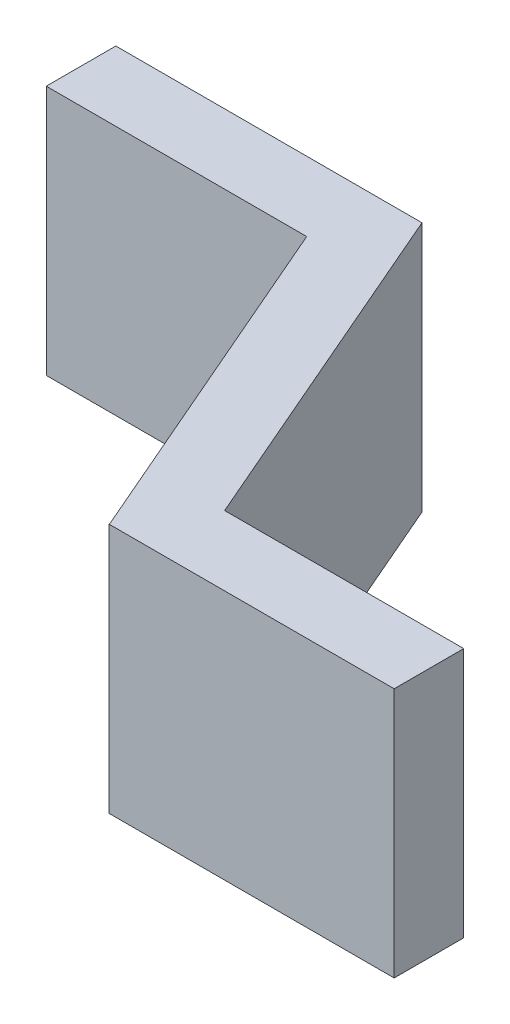
ISO-10303-21;
HEADER;
FILE_DESCRIPTION(('STEP AP214'),'2;1');
FILE_NAME('part.step','',(''),(''),'','','');
FILE_SCHEMA(('AUTOMOTIVE_DESIGN { 1 0 10303 214 1 1 1 1 }'));
ENDSEC;
DATA;
#1=APPLICATION_CONTEXT('core data for automotive mechanical design processes');
#2=APPLICATION_PROTOCOL_DEFINITION('international standard','automotive_design',2000,#1);
#3=PRODUCT_CONTEXT('',#1,'mechanical');
#4=PRODUCT('Part','Part','',(#3));
#5=PRODUCT_RELATED_PRODUCT_CATEGORY('part','',(#4));
#6=PRODUCT_DEFINITION_FORMATION('','',#4);
#7=PRODUCT_DEFINITION_CONTEXT('part definition',#1,'design');
#8=PRODUCT_DEFINITION('design','',#6,#7);
#9=PRODUCT_DEFINITION_SHAPE('','',#8);
#10=(LENGTH_UNIT() NAMED_UNIT(*) SI_UNIT(.MILLI.,.METRE.));
#11=(NAMED_UNIT(*) PLANE_ANGLE_UNIT() SI_UNIT($,.RADIAN.));
#12=(NAMED_UNIT(*) SI_UNIT($,.STERADIAN.) SOLID_ANGLE_UNIT());
#13=UNCERTAINTY_MEASURE_WITH_UNIT(LENGTH_MEASURE(1.E-05),#10,'distance_accuracy_value','');
#14=(GEOMETRIC_REPRESENTATION_CONTEXT(3) GLOBAL_UNCERTAINTY_ASSIGNED_CONTEXT((#13)) GLOBAL_UNIT_ASSIGNED_CONTEXT((#10,
#11,#12)) REPRESENTATION_CONTEXT('',''));
#15=CARTESIAN_POINT('',(0.,0.,0.));
#16=DIRECTION('',(0.,0.,1.));
#17=DIRECTION('',(1.,0.,0.));
#18=AXIS2_PLACEMENT_3D('',#15,#16,#17);
#19=CARTESIAN_POINT('',(0.,4.22,0.));
#20=DIRECTION('',(1.,0.,0.));
#21=DIRECTION('',(0.,0.,-1.));
#22=AXIS2_PLACEMENT_3D('',#19,#20,#21);
#23=PLANE('',#22);
#24=DIRECTION('',(0.,1.,0.));
#25=VECTOR('',#24,1.);
#26=CARTESIAN_POINT('',(0.,4.22,0.));
#27=LINE('',#26,#25);
#28=CARTESIAN_POINT('',(0.,4.580000014305,-1.30339419427667E-10));
#29=VERTEX_POINT('',#28);
#30=CARTESIAN_POINT('',(0.,4.22,-1.556831963824E-10));
#31=VERTEX_POINT('',#30);
#32=EDGE_CURVE('E123',#29,#31,#27,.F.);
#33=ORIENTED_EDGE('',*,*,#32,.T.);
#34=DIRECTION('',(0.,0.,1.));
#35=VECTOR('',#34,1.);
#36=CARTESIAN_POINT('',(0.,4.22,0.));
#37=LINE('',#36,#35);
#38=CARTESIAN_POINT('',(0.,4.22,0.10000000149));
#39=VERTEX_POINT('',#38);
#40=EDGE_CURVE('E115',#31,#39,#37,.T.);
#41=ORIENTED_EDGE('',*,*,#40,.T.);
#42=DIRECTION('',(0.,1.,0.));
#43=VECTOR('',#42,1.);
#44=CARTESIAN_POINT('',(0.,4.22,0.10000000149));
#45=LINE('',#44,#43);
#46=CARTESIAN_POINT('',(0.,4.580000014305,0.10000000149));
#47=VERTEX_POINT('',#46);
#48=EDGE_CURVE('E134',#47,#39,#45,.F.);
#49=ORIENTED_EDGE('',*,*,#48,.F.);
#50=DIRECTION('',(0.,0.,1.));
#51=VECTOR('',#50,1.);
#52=CARTESIAN_POINT('',(0.,4.580000014305,0.));
#53=LINE('',#52,#51);
#54=EDGE_CURVE('E140',#29,#47,#53,.T.);
#55=ORIENTED_EDGE('',*,*,#54,.F.);
#56=EDGE_LOOP('',(#33,#41,#49,#55));
#57=FACE_BOUND('',#56,.T.);
#58=ADVANCED_FACE('F17',(#57),#23,.F.);
#59=CARTESIAN_POINT('',(0.,4.22,0.10000000149));
#60=DIRECTION('',(0.,0.,1.));
#61=DIRECTION('',(1.,0.,0.));
#62=AXIS2_PLACEMENT_3D('',#59,#60,#61);
#63=PLANE('',#62);
#64=DIRECTION('',(0.,1.,0.));
#65=VECTOR('',#64,1.);
#66=CARTESIAN_POINT('',(0.374312226605181,4.22,0.100000001489922));
#67=LINE('',#66,#65);
#68=CARTESIAN_POINT('',(0.37431222660506,4.580000014305,0.100000001489974));
#69=VERTEX_POINT('',#68);
#70=CARTESIAN_POINT('',(0.374312226605091,4.22,0.100000001489974));
#71=VERTEX_POINT('',#70);
#72=EDGE_CURVE('E132',#69,#71,#67,.F.);
#73=ORIENTED_EDGE('',*,*,#72,.F.);
#74=DIRECTION('',(1.,0.,0.));
#75=VECTOR('',#74,1.);
#76=CARTESIAN_POINT('',(0.44,4.580000014305,0.10000000149));
#77=LINE('',#76,#75);
#78=EDGE_CURVE('E137',#47,#69,#77,.T.);
#79=ORIENTED_EDGE('',*,*,#78,.F.);
#80=ORIENTED_EDGE('',*,*,#48,.T.);
#81=DIRECTION('',(1.,0.,0.));
#82=VECTOR('',#81,1.);
#83=CARTESIAN_POINT('',(0.44,4.22,0.10000000149));
#84=LINE('',#83,#82);
#85=EDGE_CURVE('E111',#39,#71,#84,.T.);
#86=ORIENTED_EDGE('',*,*,#85,.T.);
#87=EDGE_LOOP('',(#73,#79,#80,#86));
#88=FACE_BOUND('',#87,.T.);
#89=ADVANCED_FACE('F214',(#88),#63,.T.);
#90=CARTESIAN_POINT('',(0.348224508223,4.22,0.03971472531736));
#91=DIRECTION('',(-0.917754904098641,0.,0.397147247255844));
#92=DIRECTION('',(0.397147247255844,0.,0.917754904098641));
#93=AXIS2_PLACEMENT_3D('',#90,#91,#92);
#94=PLANE('',#93);
#95=DIRECTION('',(0.397147247255413,0.,0.917754904098827));
#96=VECTOR('',#95,1.);
#97=CARTESIAN_POINT('',(0.374312226605,4.22,0.10000000149));
#98=LINE('',#97,#96);
#99=CARTESIAN_POINT('',(0.59,4.22,0.59842599627));
#100=VERTEX_POINT('',#99);
#101=EDGE_CURVE('E110',#71,#100,#98,.T.);
#102=ORIENTED_EDGE('',*,*,#101,.T.);
#103=DIRECTION('',(0.,1.,0.));
#104=VECTOR('',#103,1.);
#105=CARTESIAN_POINT('',(0.59,4.22,0.59842599627));
#106=LINE('',#105,#104);
#107=CARTESIAN_POINT('',(0.59,4.580000014305,0.59842599627));
#108=VERTEX_POINT('',#107);
#109=EDGE_CURVE('E86',#100,#108,#106,.T.);
#110=ORIENTED_EDGE('',*,*,#109,.T.);
#111=DIRECTION('',(0.397147247255413,0.,0.917754904098827));
#112=VECTOR('',#111,1.);
#113=CARTESIAN_POINT('',(0.374312226605,4.580000014305,0.10000000149));
#114=LINE('',#113,#112);
#115=EDGE_CURVE('E139',#69,#108,#114,.T.);
#116=ORIENTED_EDGE('',*,*,#115,.F.);
#117=ORIENTED_EDGE('',*,*,#72,.T.);
#118=EDGE_LOOP('',(#102,#110,#116,#117));
#119=FACE_BOUND('',#118,.T.);
#120=ADVANCED_FACE('F215',(#119),#94,.T.);
#121=CARTESIAN_POINT('',(0.59,4.22,0.5));
#122=DIRECTION('',(1.,0.,0.));
#123=DIRECTION('',(0.,0.,-1.));
#124=AXIS2_PLACEMENT_3D('',#121,#122,#123);
#125=PLANE('',#124);
#126=ORIENTED_EDGE('',*,*,#109,.F.);
#127=DIRECTION('',(0.,0.,-1.));
#128=VECTOR('',#127,1.);
#129=CARTESIAN_POINT('',(0.59,4.22,0.5));
#130=LINE('',#129,#128);
#131=CARTESIAN_POINT('',(0.59,4.22,0.60000000149));
#132=VERTEX_POINT('',#131);
#133=EDGE_CURVE('E20',#100,#132,#130,.F.);
#134=ORIENTED_EDGE('',*,*,#133,.T.);
#135=DIRECTION('',(0.,1.,0.));
#136=VECTOR('',#135,1.);
#137=CARTESIAN_POINT('',(0.59,4.22,0.60000000149));
#138=LINE('',#137,#136);
#139=CARTESIAN_POINT('',(0.59,4.580000014305,0.60000000149));
#140=VERTEX_POINT('',#139);
#141=EDGE_CURVE('E93',#140,#132,#138,.F.);
#142=ORIENTED_EDGE('',*,*,#141,.F.);
#143=DIRECTION('',(0.,0.,1.));
#144=VECTOR('',#143,1.);
#145=CARTESIAN_POINT('',(0.59,4.580000014305,0.));
#146=LINE('',#145,#144);
#147=EDGE_CURVE('E182',#108,#140,#146,.T.);
#148=ORIENTED_EDGE('',*,*,#147,.F.);
#149=EDGE_LOOP('',(#126,#134,#142,#148));
#150=FACE_BOUND('',#149,.T.);
#151=ADVANCED_FACE('F109',(#150),#125,.F.);
#152=CARTESIAN_POINT('',(0.59,4.22,0.60000000149));
#153=DIRECTION('',(0.,0.,1.));
#154=DIRECTION('',(1.,0.,0.));
#155=AXIS2_PLACEMENT_3D('',#152,#153,#154);
#156=PLANE('',#155);
#157=ORIENTED_EDGE('',*,*,#141,.T.);
#158=DIRECTION('',(1.,0.,0.));
#159=VECTOR('',#158,1.);
#160=CARTESIAN_POINT('',(0.44,4.22,0.60000000149));
#161=LINE('',#160,#159);
#162=CARTESIAN_POINT('',(0.999999996424,4.22,0.60000000149));
#163=VERTEX_POINT('',#162);
#164=EDGE_CURVE('E97',#132,#163,#161,.T.);
#165=ORIENTED_EDGE('',*,*,#164,.T.);
#166=DIRECTION('',(0.,1.,0.));
#167=VECTOR('',#166,1.);
#168=CARTESIAN_POINT('',(0.999999996424,4.22,0.60000000149));
#169=LINE('',#168,#167);
#170=CARTESIAN_POINT('',(0.999999996424,4.580000014305,0.60000000149));
#171=VERTEX_POINT('',#170);
#172=EDGE_CURVE('E99',#171,#163,#169,.F.);
#173=ORIENTED_EDGE('',*,*,#172,.F.);
#174=DIRECTION('',(1.,0.,0.));
#175=VECTOR('',#174,1.);
#176=CARTESIAN_POINT('',(0.44,4.580000014305,0.60000000149));
#177=LINE('',#176,#175);
#178=EDGE_CURVE('E98',#140,#171,#177,.T.);
#179=ORIENTED_EDGE('',*,*,#178,.F.);
#180=EDGE_LOOP('',(#157,#165,#173,#179));
#181=FACE_BOUND('',#180,.T.);
#182=ADVANCED_FACE('F95',(#181),#156,.T.);
#183=CARTESIAN_POINT('',(0.999999996424,4.22,0.5));
#184=DIRECTION('',(1.,0.,0.));
#185=DIRECTION('',(0.,0.,-1.));
#186=AXIS2_PLACEMENT_3D('',#183,#184,#185);
#187=PLANE('',#186);
#188=DIRECTION('',(0.,0.,1.));
#189=VECTOR('',#188,1.);
#190=CARTESIAN_POINT('',(0.999999996424,4.22,0.));
#191=LINE('',#190,#189);
#192=CARTESIAN_POINT('',(0.999999996424,4.22,0.5));
#193=VERTEX_POINT('',#192);
#194=EDGE_CURVE('E107',#163,#193,#191,.F.);
#195=ORIENTED_EDGE('',*,*,#194,.T.);
#196=DIRECTION('',(0.,1.,0.));
#197=VECTOR('',#196,1.);
#198=CARTESIAN_POINT('',(0.999999996424,4.22,0.5));
#199=LINE('',#198,#197);
#200=CARTESIAN_POINT('',(0.999999996424,4.580000014305,0.5));
#201=VERTEX_POINT('',#200);
#202=EDGE_CURVE('E192',#193,#201,#199,.T.);
#203=ORIENTED_EDGE('',*,*,#202,.T.);
#204=DIRECTION('',(0.,0.,1.));
#205=VECTOR('',#204,1.);
#206=CARTESIAN_POINT('',(0.999999996424,4.580000014305,0.));
#207=LINE('',#206,#205);
#208=EDGE_CURVE('E126',#171,#201,#207,.F.);
#209=ORIENTED_EDGE('',*,*,#208,.F.);
#210=ORIENTED_EDGE('',*,*,#172,.T.);
#211=EDGE_LOOP('',(#195,#203,#209,#210));
#212=FACE_BOUND('',#211,.T.);
#213=ADVANCED_FACE('F238',(#212),#187,.T.);
#214=CARTESIAN_POINT('',(0.,4.22,0.));
#215=DIRECTION('',(0.,0.,1.));
#216=DIRECTION('',(1.,0.,0.));
#217=AXIS2_PLACEMENT_3D('',#214,#215,#216);
#218=PLANE('',#217);
#219=DIRECTION('',(1.,0.,0.));
#220=VECTOR('',#219,1.);
#221=CARTESIAN_POINT('',(0.44,4.22,-2.335247945736E-10));
#222=LINE('',#221,#220);
#223=CARTESIAN_POINT('',(0.439999999656335,4.22,-3.43069646239979E-10));
#224=VERTEX_POINT('',#223);
#225=EDGE_CURVE('E155',#224,#31,#222,.F.);
#226=ORIENTED_EDGE('',*,*,#225,.T.);
#227=ORIENTED_EDGE('',*,*,#32,.F.);
#228=DIRECTION('',(1.,0.,0.));
#229=VECTOR('',#228,1.);
#230=CARTESIAN_POINT('',(0.44,4.580000014305,-1.955091291415E-10));
#231=LINE('',#230,#229);
#232=CARTESIAN_POINT('',(0.439999999458534,4.580000014305,-1.955091291415E-10));
#233=VERTEX_POINT('',#232);
#234=EDGE_CURVE('E147',#233,#29,#231,.F.);
#235=ORIENTED_EDGE('',*,*,#234,.F.);
#236=DIRECTION('',(0.,1.,0.));
#237=VECTOR('',#236,1.);
#238=CARTESIAN_POINT('',(0.439999999804137,4.22,-4.52614497906357E-10));
#239=LINE('',#238,#237);
#240=EDGE_CURVE('E128',#233,#224,#239,.F.);
#241=ORIENTED_EDGE('',*,*,#240,.T.);
#242=EDGE_LOOP('',(#226,#227,#235,#241));
#243=FACE_BOUND('',#242,.T.);
#244=ADVANCED_FACE('F235',(#243),#218,.F.);
#245=CARTESIAN_POINT('',(0.44,4.22,0.));
#246=DIRECTION('',(0.,1.,0.));
#247=DIRECTION('',(0.,0.,1.));
#248=AXIS2_PLACEMENT_3D('',#245,#246,#247);
#249=PLANE('',#248);
#250=DIRECTION('',(1.,0.,0.));
#251=VECTOR('',#250,1.);
#252=CARTESIAN_POINT('',(0.59,4.22,0.5));
#253=LINE('',#252,#251);
#254=CARTESIAN_POINT('',(0.656368904967001,4.22,0.499999999999999));
#255=VERTEX_POINT('',#254);
#256=EDGE_CURVE('E166',#255,#193,#253,.T.);
#257=ORIENTED_EDGE('',*,*,#256,.T.);
#258=ORIENTED_EDGE('',*,*,#194,.F.);
#259=ORIENTED_EDGE('',*,*,#164,.F.);
#260=ORIENTED_EDGE('',*,*,#133,.F.);
#261=ORIENTED_EDGE('',*,*,#101,.F.);
#262=ORIENTED_EDGE('',*,*,#85,.F.);
#263=ORIENTED_EDGE('',*,*,#40,.F.);
#264=ORIENTED_EDGE('',*,*,#225,.F.);
#265=DIRECTION('',(0.397147247255844,0.,0.917754904098641));
#266=VECTOR('',#265,1.);
#267=CARTESIAN_POINT('',(0.44,4.22,0.));
#268=LINE('',#267,#266);
#269=EDGE_CURVE('E160',#224,#255,#268,.T.);
#270=ORIENTED_EDGE('',*,*,#269,.T.);
#271=EDGE_LOOP('',(#257,#258,#259,#260,#261,#262,#263,#264,#270));
#272=FACE_BOUND('',#271,.T.);
#273=ADVANCED_FACE('F104',(#272),#249,.F.);
#274=CARTESIAN_POINT('',(0.59,4.22,0.5));
#275=DIRECTION('',(0.,0.,1.));
#276=DIRECTION('',(1.,0.,0.));
#277=AXIS2_PLACEMENT_3D('',#274,#275,#276);
#278=PLANE('',#277);
#279=ORIENTED_EDGE('',*,*,#256,.F.);
#280=DIRECTION('',(0.,1.,0.));
#281=VECTOR('',#280,1.);
#282=CARTESIAN_POINT('',(0.656368904967005,4.22,0.499999999999998));
#283=LINE('',#282,#281);
#284=CARTESIAN_POINT('',(0.656368904967001,4.580000014305,0.499999999999999));
#285=VERTEX_POINT('',#284);
#286=EDGE_CURVE('E26',#255,#285,#283,.T.);
#287=ORIENTED_EDGE('',*,*,#286,.T.);
#288=DIRECTION('',(1.,0.,0.));
#289=VECTOR('',#288,1.);
#290=CARTESIAN_POINT('',(0.44,4.580000014305,0.5));
#291=LINE('',#290,#289);
#292=EDGE_CURVE('E34',#201,#285,#291,.F.);
#293=ORIENTED_EDGE('',*,*,#292,.F.);
#294=ORIENTED_EDGE('',*,*,#202,.F.);
#295=EDGE_LOOP('',(#279,#287,#293,#294));
#296=FACE_BOUND('',#295,.T.);
#297=ADVANCED_FACE('F199',(#296),#278,.F.);
#298=CARTESIAN_POINT('',(0.44,4.580000014305,0.));
#299=DIRECTION('',(0.,1.,0.));
#300=DIRECTION('',(0.,0.,1.));
#301=AXIS2_PLACEMENT_3D('',#298,#299,#300);
#302=PLANE('',#301);
#303=ORIENTED_EDGE('',*,*,#178,.T.);
#304=ORIENTED_EDGE('',*,*,#208,.T.);
#305=ORIENTED_EDGE('',*,*,#292,.T.);
#306=DIRECTION('',(0.397147247255844,0.,0.917754904098641));
#307=VECTOR('',#306,1.);
#308=CARTESIAN_POINT('',(0.44,4.580000014305,0.));
#309=LINE('',#308,#307);
#310=EDGE_CURVE('E11',#285,#233,#309,.F.);
#311=ORIENTED_EDGE('',*,*,#310,.T.);
#312=ORIENTED_EDGE('',*,*,#234,.T.);
#313=ORIENTED_EDGE('',*,*,#54,.T.);
#314=ORIENTED_EDGE('',*,*,#78,.T.);
#315=ORIENTED_EDGE('',*,*,#115,.T.);
#316=ORIENTED_EDGE('',*,*,#147,.T.);
#317=EDGE_LOOP('',(#303,#304,#305,#311,#312,#313,#314,#315,#316));
#318=FACE_BOUND('',#317,.T.);
#319=ADVANCED_FACE('F204',(#318),#302,.T.);
#320=CARTESIAN_POINT('',(0.44,4.22,0.));
#321=DIRECTION('',(-0.917754904098641,0.,0.397147247255844));
#322=DIRECTION('',(0.397147247255844,0.,0.917754904098641));
#323=AXIS2_PLACEMENT_3D('',#320,#321,#322);
#324=PLANE('',#323);
#325=ORIENTED_EDGE('',*,*,#286,.F.);
#326=ORIENTED_EDGE('',*,*,#269,.F.);
#327=ORIENTED_EDGE('',*,*,#240,.F.);
#328=ORIENTED_EDGE('',*,*,#310,.F.);
#329=EDGE_LOOP('',(#325,#326,#327,#328));
#330=FACE_BOUND('',#329,.T.);
#331=ADVANCED_FACE('F201',(#330),#324,.F.);
#332=CLOSED_SHELL('',(#58,#89,#120,#151,#182,#213,#244,#273,#297,#319,#331));
#333=MANIFOLD_SOLID_BREP('B1',#332);
#334=ADVANCED_BREP_SHAPE_REPRESENTATION('',(#18,#333),#14);
#335=SHAPE_DEFINITION_REPRESENTATION(#9,#334);
ENDSEC;
END-ISO-10303-21;
